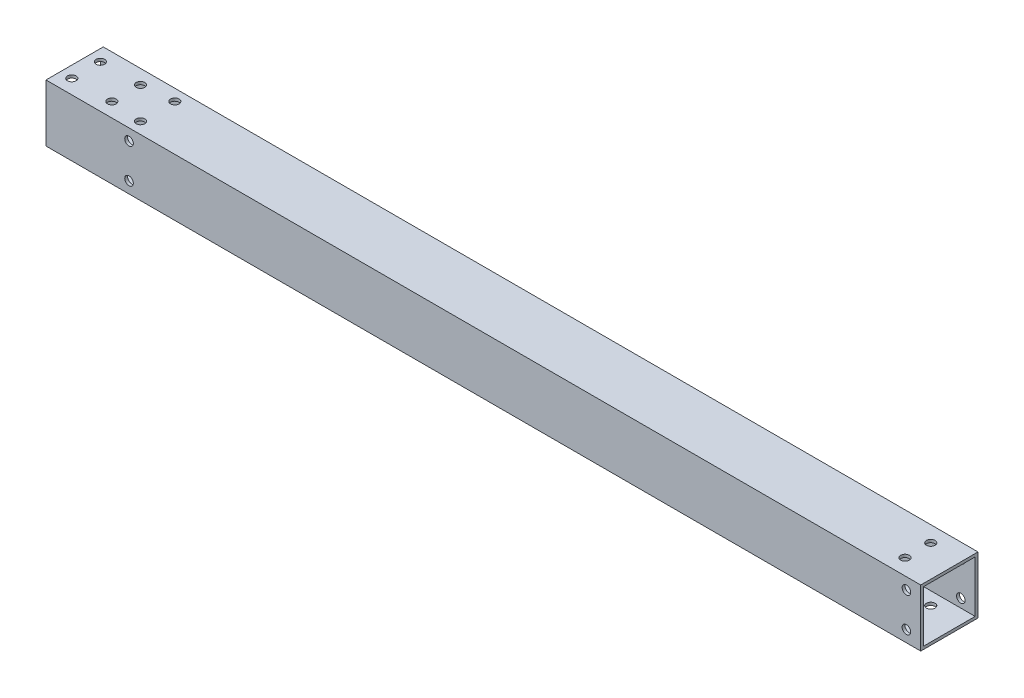
ISO-10303-21;
HEADER;
FILE_DESCRIPTION(('STEP AP214'),'2;1');
FILE_NAME('part.step','',(''),(''),'','','');
FILE_SCHEMA(('AUTOMOTIVE_DESIGN { 1 0 10303 214 1 1 1 1 }'));
ENDSEC;
DATA;
#1=APPLICATION_CONTEXT('core data for automotive mechanical design processes');
#2=APPLICATION_PROTOCOL_DEFINITION('international standard','automotive_design',2000,#1);
#3=PRODUCT_CONTEXT('',#1,'mechanical');
#4=PRODUCT('Part','Part','',(#3));
#5=PRODUCT_RELATED_PRODUCT_CATEGORY('part','',(#4));
#6=PRODUCT_DEFINITION_FORMATION('','',#4);
#7=PRODUCT_DEFINITION_CONTEXT('part definition',#1,'design');
#8=PRODUCT_DEFINITION('design','',#6,#7);
#9=PRODUCT_DEFINITION_SHAPE('','',#8);
#10=(LENGTH_UNIT() NAMED_UNIT(*) SI_UNIT(.MILLI.,.METRE.));
#11=(NAMED_UNIT(*) PLANE_ANGLE_UNIT() SI_UNIT($,.RADIAN.));
#12=(NAMED_UNIT(*) SI_UNIT($,.STERADIAN.) SOLID_ANGLE_UNIT());
#13=UNCERTAINTY_MEASURE_WITH_UNIT(LENGTH_MEASURE(1.E-05),#10,'distance_accuracy_value','');
#14=(GEOMETRIC_REPRESENTATION_CONTEXT(3) GLOBAL_UNCERTAINTY_ASSIGNED_CONTEXT((#13)) GLOBAL_UNIT_ASSIGNED_CONTEXT((#10,
#11,#12)) REPRESENTATION_CONTEXT('',''));
#15=CARTESIAN_POINT('',(0.,0.,0.));
#16=DIRECTION('',(0.,0.,1.));
#17=DIRECTION('',(1.,0.,0.));
#18=AXIS2_PLACEMENT_3D('',#15,#16,#17);
#19=CARTESIAN_POINT('',(305.54,-9.,-9.));
#20=DIRECTION('',(0.,0.,1.));
#21=DIRECTION('',(1.,0.,0.));
#22=AXIS2_PLACEMENT_3D('',#19,#20,#21);
#23=PLANE('',#22);
#24=CARTESIAN_POINT('',(300.54,6.,-9.));
#25=DIRECTION('',(0.,0.,1.));
#26=DIRECTION('',(1.,0.,0.));
#27=AXIS2_PLACEMENT_3D('',#24,#25,#26);
#28=CIRCLE('',#27,1.50000000000002);
#29=CARTESIAN_POINT('',(302.04,6.,-9.));
#30=VERTEX_POINT('',#29);
#31=EDGE_CURVE('E244',#30,#30,#28,.T.);
#32=ORIENTED_EDGE('',*,*,#31,.F.);
#33=EDGE_LOOP('',(#32));
#34=FACE_BOUND('',#33,.T.);
#35=CARTESIAN_POINT('',(300.54,-6.,-9.));
#36=DIRECTION('',(0.,0.,1.));
#37=DIRECTION('',(1.,0.,0.));
#38=AXIS2_PLACEMENT_3D('',#35,#36,#37);
#39=CIRCLE('',#38,1.50000000000002);
#40=CARTESIAN_POINT('',(302.04,-6.,-9.));
#41=VERTEX_POINT('',#40);
#42=EDGE_CURVE('E238',#41,#41,#39,.T.);
#43=ORIENTED_EDGE('',*,*,#42,.F.);
#44=EDGE_LOOP('',(#43));
#45=FACE_BOUND('',#44,.T.);
#46=CARTESIAN_POINT('',(29.,-6.,-9.));
#47=DIRECTION('',(0.,0.,1.));
#48=DIRECTION('',(1.,0.,0.));
#49=AXIS2_PLACEMENT_3D('',#46,#47,#48);
#50=CIRCLE('',#49,1.5);
#51=CARTESIAN_POINT('',(30.5,-6.,-9.));
#52=VERTEX_POINT('',#51);
#53=EDGE_CURVE('E285',#52,#52,#50,.F.);
#54=ORIENTED_EDGE('',*,*,#53,.T.);
#55=EDGE_LOOP('',(#54));
#56=FACE_BOUND('',#55,.T.);
#57=CARTESIAN_POINT('',(29.,6.,-9.));
#58=DIRECTION('',(0.,0.,1.));
#59=DIRECTION('',(1.,0.,0.));
#60=AXIS2_PLACEMENT_3D('',#57,#58,#59);
#61=CIRCLE('',#60,1.5);
#62=CARTESIAN_POINT('',(30.5,6.,-9.));
#63=VERTEX_POINT('',#62);
#64=EDGE_CURVE('E152',#63,#63,#61,.F.);
#65=ORIENTED_EDGE('',*,*,#64,.T.);
#66=EDGE_LOOP('',(#65));
#67=FACE_BOUND('',#66,.T.);
#68=DIRECTION('',(0.,1.,0.));
#69=VECTOR('',#68,1.);
#70=CARTESIAN_POINT('',(0.,-9.,-9.));
#71=LINE('',#70,#69);
#72=CARTESIAN_POINT('',(0.,-9.,-9.));
#73=VERTEX_POINT('',#72);
#74=CARTESIAN_POINT('',(0.,9.,-9.));
#75=VERTEX_POINT('',#74);
#76=EDGE_CURVE('E158',#73,#75,#71,.T.);
#77=ORIENTED_EDGE('',*,*,#76,.F.);
#78=DIRECTION('',(-1.,0.,0.));
#79=VECTOR('',#78,1.);
#80=CARTESIAN_POINT('',(305.54,-9.,-9.));
#81=LINE('',#80,#79);
#82=CARTESIAN_POINT('',(305.54,-9.,-9.));
#83=VERTEX_POINT('',#82);
#84=EDGE_CURVE('E12',#83,#73,#81,.T.);
#85=ORIENTED_EDGE('',*,*,#84,.F.);
#86=DIRECTION('',(0.,1.,0.));
#87=VECTOR('',#86,1.);
#88=CARTESIAN_POINT('',(305.54,-9.,-9.));
#89=LINE('',#88,#87);
#90=CARTESIAN_POINT('',(305.54,9.,-9.));
#91=VERTEX_POINT('',#90);
#92=EDGE_CURVE('E139',#83,#91,#89,.T.);
#93=ORIENTED_EDGE('',*,*,#92,.T.);
#94=DIRECTION('',(-1.,0.,0.));
#95=VECTOR('',#94,1.);
#96=CARTESIAN_POINT('',(305.54,9.,-9.));
#97=LINE('',#96,#95);
#98=EDGE_CURVE('E70',#91,#75,#97,.T.);
#99=ORIENTED_EDGE('',*,*,#98,.T.);
#100=EDGE_LOOP('',(#77,#85,#93,#99));
#101=FACE_BOUND('',#100,.T.);
#102=ADVANCED_FACE('F51',(#34,#45,#56,#67,#101),#23,.T.);
#103=CARTESIAN_POINT('',(305.54,-9.,9.));
#104=DIRECTION('',(0.,1.,0.));
#105=DIRECTION('',(0.,0.,1.));
#106=AXIS2_PLACEMENT_3D('',#103,#104,#105);
#107=PLANE('',#106);
#108=CARTESIAN_POINT('',(4.,-9.,5.));
#109=DIRECTION('',(0.,1.,0.));
#110=DIRECTION('',(0.,0.,1.));
#111=AXIS2_PLACEMENT_3D('',#108,#109,#110);
#112=CIRCLE('',#111,1.5);
#113=CARTESIAN_POINT('',(4.,-9.,6.5));
#114=VERTEX_POINT('',#113);
#115=EDGE_CURVE('E220',#114,#114,#112,.T.);
#116=ORIENTED_EDGE('',*,*,#115,.F.);
#117=EDGE_LOOP('',(#116));
#118=FACE_BOUND('',#117,.T.);
#119=CARTESIAN_POINT('',(18.,-9.,-5.));
#120=DIRECTION('',(0.,1.,0.));
#121=DIRECTION('',(0.,0.,1.));
#122=AXIS2_PLACEMENT_3D('',#119,#120,#121);
#123=CIRCLE('',#122,1.5);
#124=CARTESIAN_POINT('',(18.,-9.,-3.5));
#125=VERTEX_POINT('',#124);
#126=EDGE_CURVE('E208',#125,#125,#123,.T.);
#127=ORIENTED_EDGE('',*,*,#126,.F.);
#128=EDGE_LOOP('',(#127));
#129=FACE_BOUND('',#128,.T.);
#130=CARTESIAN_POINT('',(18.,-9.,5.));
#131=DIRECTION('',(0.,1.,0.));
#132=DIRECTION('',(0.,0.,1.));
#133=AXIS2_PLACEMENT_3D('',#130,#131,#132);
#134=CIRCLE('',#133,1.5);
#135=CARTESIAN_POINT('',(18.,-9.,6.5));
#136=VERTEX_POINT('',#135);
#137=EDGE_CURVE('E205',#136,#136,#134,.T.);
#138=ORIENTED_EDGE('',*,*,#137,.F.);
#139=EDGE_LOOP('',(#138));
#140=FACE_BOUND('',#139,.T.);
#141=CARTESIAN_POINT('',(4.,-9.,-5.));
#142=DIRECTION('',(0.,1.,0.));
#143=DIRECTION('',(0.,0.,1.));
#144=AXIS2_PLACEMENT_3D('',#141,#142,#143);
#145=CIRCLE('',#144,1.5);
#146=CARTESIAN_POINT('',(4.,-9.,-3.5));
#147=VERTEX_POINT('',#146);
#148=EDGE_CURVE('E201',#147,#147,#145,.T.);
#149=ORIENTED_EDGE('',*,*,#148,.F.);
#150=EDGE_LOOP('',(#149));
#151=FACE_BOUND('',#150,.T.);
#152=CARTESIAN_POINT('',(294.54,-9.,-4.5));
#153=DIRECTION('',(0.,1.,0.));
#154=DIRECTION('',(0.,0.,1.));
#155=AXIS2_PLACEMENT_3D('',#152,#153,#154);
#156=CIRCLE('',#155,1.50000000000002);
#157=CARTESIAN_POINT('',(294.54,-9.,-2.99999999999997));
#158=VERTEX_POINT('',#157);
#159=EDGE_CURVE('E197',#158,#158,#156,.T.);
#160=ORIENTED_EDGE('',*,*,#159,.F.);
#161=EDGE_LOOP('',(#160));
#162=FACE_BOUND('',#161,.T.);
#163=CARTESIAN_POINT('',(294.54,-9.,4.5));
#164=DIRECTION('',(0.,1.,0.));
#165=DIRECTION('',(0.,0.,1.));
#166=AXIS2_PLACEMENT_3D('',#163,#164,#165);
#167=CIRCLE('',#166,1.50000000000002);
#168=CARTESIAN_POINT('',(294.54,-9.,6.00000000000003));
#169=VERTEX_POINT('',#168);
#170=EDGE_CURVE('E192',#169,#169,#167,.T.);
#171=ORIENTED_EDGE('',*,*,#170,.F.);
#172=EDGE_LOOP('',(#171));
#173=FACE_BOUND('',#172,.T.);
#174=CARTESIAN_POINT('',(29.,-9.,6.));
#175=DIRECTION('',(0.,1.,0.));
#176=DIRECTION('',(0.,0.,1.));
#177=AXIS2_PLACEMENT_3D('',#174,#175,#176);
#178=CIRCLE('',#177,1.5);
#179=CARTESIAN_POINT('',(29.,-9.,7.5));
#180=VERTEX_POINT('',#179);
#181=EDGE_CURVE('E187',#180,#180,#178,.T.);
#182=ORIENTED_EDGE('',*,*,#181,.F.);
#183=EDGE_LOOP('',(#182));
#184=FACE_BOUND('',#183,.T.);
#185=CARTESIAN_POINT('',(29.,-9.,-6.));
#186=DIRECTION('',(0.,1.,0.));
#187=DIRECTION('',(0.,0.,1.));
#188=AXIS2_PLACEMENT_3D('',#185,#186,#187);
#189=CIRCLE('',#188,1.5);
#190=CARTESIAN_POINT('',(29.,-9.,-4.5));
#191=VERTEX_POINT('',#190);
#192=EDGE_CURVE('E182',#191,#191,#189,.T.);
#193=ORIENTED_EDGE('',*,*,#192,.F.);
#194=EDGE_LOOP('',(#193));
#195=FACE_BOUND('',#194,.T.);
#196=DIRECTION('',(0.,0.,-1.));
#197=VECTOR('',#196,1.);
#198=CARTESIAN_POINT('',(0.,-9.,9.));
#199=LINE('',#198,#197);
#200=CARTESIAN_POINT('',(0.,-9.,9.));
#201=VERTEX_POINT('',#200);
#202=EDGE_CURVE('E128',#201,#73,#199,.T.);
#203=ORIENTED_EDGE('',*,*,#202,.F.);
#204=DIRECTION('',(-1.,0.,0.));
#205=VECTOR('',#204,1.);
#206=CARTESIAN_POINT('',(305.54,-9.,9.));
#207=LINE('',#206,#205);
#208=CARTESIAN_POINT('',(305.54,-9.,9.));
#209=VERTEX_POINT('',#208);
#210=EDGE_CURVE('E61',#209,#201,#207,.T.);
#211=ORIENTED_EDGE('',*,*,#210,.F.);
#212=DIRECTION('',(0.,0.,-1.));
#213=VECTOR('',#212,1.);
#214=CARTESIAN_POINT('',(305.54,-9.,9.));
#215=LINE('',#214,#213);
#216=EDGE_CURVE('E126',#209,#83,#215,.T.);
#217=ORIENTED_EDGE('',*,*,#216,.T.);
#218=ORIENTED_EDGE('',*,*,#84,.T.);
#219=EDGE_LOOP('',(#203,#211,#217,#218));
#220=FACE_BOUND('',#219,.T.);
#221=ADVANCED_FACE('F125',(#118,#129,#140,#151,#162,#173,#184,#195,#220),#107,.T.);
#222=CARTESIAN_POINT('',(305.54,-9.,9.));
#223=DIRECTION('',(0.,0.,-1.));
#224=DIRECTION('',(-1.,0.,0.));
#225=AXIS2_PLACEMENT_3D('',#222,#223,#224);
#226=PLANE('',#225);
#227=CARTESIAN_POINT('',(300.54,6.,9.));
#228=DIRECTION('',(0.,0.,-1.));
#229=DIRECTION('',(-1.,0.,0.));
#230=AXIS2_PLACEMENT_3D('',#227,#228,#229);
#231=CIRCLE('',#230,1.50000000000002);
#232=CARTESIAN_POINT('',(299.04,6.,9.));
#233=VERTEX_POINT('',#232);
#234=EDGE_CURVE('E241',#233,#233,#231,.T.);
#235=ORIENTED_EDGE('',*,*,#234,.F.);
#236=EDGE_LOOP('',(#235));
#237=FACE_BOUND('',#236,.T.);
#238=CARTESIAN_POINT('',(300.54,-6.,9.));
#239=DIRECTION('',(0.,0.,-1.));
#240=DIRECTION('',(-1.,0.,0.));
#241=AXIS2_PLACEMENT_3D('',#238,#239,#240);
#242=CIRCLE('',#241,1.50000000000002);
#243=CARTESIAN_POINT('',(299.04,-6.,9.));
#244=VERTEX_POINT('',#243);
#245=EDGE_CURVE('E227',#244,#244,#242,.T.);
#246=ORIENTED_EDGE('',*,*,#245,.F.);
#247=EDGE_LOOP('',(#246));
#248=FACE_BOUND('',#247,.T.);
#249=CARTESIAN_POINT('',(29.,-6.,9.));
#250=DIRECTION('',(0.,0.,-1.));
#251=DIRECTION('',(-1.,0.,0.));
#252=AXIS2_PLACEMENT_3D('',#249,#250,#251);
#253=CIRCLE('',#252,1.5);
#254=CARTESIAN_POINT('',(27.5,-6.,9.));
#255=VERTEX_POINT('',#254);
#256=EDGE_CURVE('E280',#255,#255,#253,.F.);
#257=ORIENTED_EDGE('',*,*,#256,.T.);
#258=EDGE_LOOP('',(#257));
#259=FACE_BOUND('',#258,.T.);
#260=CARTESIAN_POINT('',(29.,6.,9.));
#261=DIRECTION('',(0.,0.,-1.));
#262=DIRECTION('',(-1.,0.,0.));
#263=AXIS2_PLACEMENT_3D('',#260,#261,#262);
#264=CIRCLE('',#263,1.5);
#265=CARTESIAN_POINT('',(27.5,6.,9.));
#266=VERTEX_POINT('',#265);
#267=EDGE_CURVE('E292',#266,#266,#264,.F.);
#268=ORIENTED_EDGE('',*,*,#267,.T.);
#269=EDGE_LOOP('',(#268));
#270=FACE_BOUND('',#269,.T.);
#271=DIRECTION('',(0.,-1.,0.));
#272=VECTOR('',#271,1.);
#273=CARTESIAN_POINT('',(0.,-9.,9.));
#274=LINE('',#273,#272);
#275=CARTESIAN_POINT('',(0.,9.,9.));
#276=VERTEX_POINT('',#275);
#277=EDGE_CURVE('E161',#276,#201,#274,.T.);
#278=ORIENTED_EDGE('',*,*,#277,.F.);
#279=DIRECTION('',(-1.,0.,0.));
#280=VECTOR('',#279,1.);
#281=CARTESIAN_POINT('',(305.54,9.,9.));
#282=LINE('',#281,#280);
#283=CARTESIAN_POINT('',(305.54,9.,9.));
#284=VERTEX_POINT('',#283);
#285=EDGE_CURVE('E95',#284,#276,#282,.T.);
#286=ORIENTED_EDGE('',*,*,#285,.F.);
#287=DIRECTION('',(0.,-1.,0.));
#288=VECTOR('',#287,1.);
#289=CARTESIAN_POINT('',(305.54,-9.,9.));
#290=LINE('',#289,#288);
#291=EDGE_CURVE('E138',#284,#209,#290,.T.);
#292=ORIENTED_EDGE('',*,*,#291,.T.);
#293=ORIENTED_EDGE('',*,*,#210,.T.);
#294=EDGE_LOOP('',(#278,#286,#292,#293));
#295=FACE_BOUND('',#294,.T.);
#296=ADVANCED_FACE('F141',(#237,#248,#259,#270,#295),#226,.T.);
#297=CARTESIAN_POINT('',(305.54,-10.,-10.));
#298=DIRECTION('',(0.,0.,1.));
#299=DIRECTION('',(1.,0.,0.));
#300=AXIS2_PLACEMENT_3D('',#297,#298,#299);
#301=PLANE('',#300);
#302=CARTESIAN_POINT('',(300.54,6.,-10.));
#303=DIRECTION('',(0.,0.,-1.));
#304=DIRECTION('',(-1.,0.,0.));
#305=AXIS2_PLACEMENT_3D('',#302,#303,#304);
#306=CIRCLE('',#305,1.50000000000002);
#307=CARTESIAN_POINT('',(299.04,6.,-10.));
#308=VERTEX_POINT('',#307);
#309=EDGE_CURVE('E228',#308,#308,#306,.T.);
#310=ORIENTED_EDGE('',*,*,#309,.F.);
#311=EDGE_LOOP('',(#310));
#312=FACE_BOUND('',#311,.T.);
#313=CARTESIAN_POINT('',(300.54,-6.,-10.));
#314=DIRECTION('',(0.,0.,-1.));
#315=DIRECTION('',(-1.,0.,0.));
#316=AXIS2_PLACEMENT_3D('',#313,#314,#315);
#317=CIRCLE('',#316,1.50000000000002);
#318=CARTESIAN_POINT('',(299.04,-6.,-10.));
#319=VERTEX_POINT('',#318);
#320=EDGE_CURVE('E223',#319,#319,#317,.T.);
#321=ORIENTED_EDGE('',*,*,#320,.F.);
#322=EDGE_LOOP('',(#321));
#323=FACE_BOUND('',#322,.T.);
#324=CARTESIAN_POINT('',(29.,-6.,-10.));
#325=DIRECTION('',(0.,0.,-1.));
#326=DIRECTION('',(-1.,0.,0.));
#327=AXIS2_PLACEMENT_3D('',#324,#325,#326);
#328=CIRCLE('',#327,1.5);
#329=CARTESIAN_POINT('',(27.5,-6.,-10.));
#330=VERTEX_POINT('',#329);
#331=EDGE_CURVE('E277',#330,#330,#328,.T.);
#332=ORIENTED_EDGE('',*,*,#331,.F.);
#333=EDGE_LOOP('',(#332));
#334=FACE_BOUND('',#333,.T.);
#335=CARTESIAN_POINT('',(29.,6.,-10.));
#336=DIRECTION('',(0.,0.,-1.));
#337=DIRECTION('',(-1.,0.,0.));
#338=AXIS2_PLACEMENT_3D('',#335,#336,#337);
#339=CIRCLE('',#338,1.5);
#340=CARTESIAN_POINT('',(27.5,6.,-10.));
#341=VERTEX_POINT('',#340);
#342=EDGE_CURVE('E289',#341,#341,#339,.T.);
#343=ORIENTED_EDGE('',*,*,#342,.F.);
#344=EDGE_LOOP('',(#343));
#345=FACE_BOUND('',#344,.T.);
#346=DIRECTION('',(0.,1.,0.));
#347=VECTOR('',#346,1.);
#348=CARTESIAN_POINT('',(0.,-10.,-10.));
#349=LINE('',#348,#347);
#350=CARTESIAN_POINT('',(0.,-10.,-10.));
#351=VERTEX_POINT('',#350);
#352=CARTESIAN_POINT('',(0.,10.,-10.));
#353=VERTEX_POINT('',#352);
#354=EDGE_CURVE('E148',#351,#353,#349,.T.);
#355=ORIENTED_EDGE('',*,*,#354,.T.);
#356=DIRECTION('',(-1.,0.,0.));
#357=VECTOR('',#356,1.);
#358=CARTESIAN_POINT('',(305.54,10.,-10.));
#359=LINE('',#358,#357);
#360=CARTESIAN_POINT('',(305.54,10.,-10.));
#361=VERTEX_POINT('',#360);
#362=EDGE_CURVE('E168',#361,#353,#359,.T.);
#363=ORIENTED_EDGE('',*,*,#362,.F.);
#364=DIRECTION('',(0.,1.,0.));
#365=VECTOR('',#364,1.);
#366=CARTESIAN_POINT('',(305.54,-10.,-10.));
#367=LINE('',#366,#365);
#368=CARTESIAN_POINT('',(305.54,-10.,-10.));
#369=VERTEX_POINT('',#368);
#370=EDGE_CURVE('E166',#369,#361,#367,.T.);
#371=ORIENTED_EDGE('',*,*,#370,.F.);
#372=DIRECTION('',(-1.,0.,0.));
#373=VECTOR('',#372,1.);
#374=CARTESIAN_POINT('',(305.54,-10.,-10.));
#375=LINE('',#374,#373);
#376=EDGE_CURVE('E144',#369,#351,#375,.T.);
#377=ORIENTED_EDGE('',*,*,#376,.T.);
#378=EDGE_LOOP('',(#355,#363,#371,#377));
#379=FACE_BOUND('',#378,.T.);
#380=ADVANCED_FACE('F53',(#312,#323,#334,#345,#379),#301,.F.);
#381=CARTESIAN_POINT('',(305.54,10.,10.));
#382=DIRECTION('',(0.,-1.,0.));
#383=DIRECTION('',(0.,0.,-1.));
#384=AXIS2_PLACEMENT_3D('',#381,#382,#383);
#385=PLANE('',#384);
#386=CARTESIAN_POINT('',(4.,10.,5.));
#387=DIRECTION('',(0.,1.,0.));
#388=DIRECTION('',(0.,0.,1.));
#389=AXIS2_PLACEMENT_3D('',#386,#387,#388);
#390=CIRCLE('',#389,1.5);
#391=CARTESIAN_POINT('',(4.,10.,6.5));
#392=VERTEX_POINT('',#391);
#393=EDGE_CURVE('E346',#392,#392,#390,.T.);
#394=ORIENTED_EDGE('',*,*,#393,.F.);
#395=EDGE_LOOP('',(#394));
#396=FACE_BOUND('',#395,.T.);
#397=CARTESIAN_POINT('',(18.,10.,-5.));
#398=DIRECTION('',(0.,1.,0.));
#399=DIRECTION('',(0.,0.,1.));
#400=AXIS2_PLACEMENT_3D('',#397,#398,#399);
#401=CIRCLE('',#400,1.5);
#402=CARTESIAN_POINT('',(18.,10.,-3.5));
#403=VERTEX_POINT('',#402);
#404=EDGE_CURVE('E350',#403,#403,#401,.T.);
#405=ORIENTED_EDGE('',*,*,#404,.F.);
#406=EDGE_LOOP('',(#405));
#407=FACE_BOUND('',#406,.T.);
#408=CARTESIAN_POINT('',(18.,10.,5.));
#409=DIRECTION('',(0.,1.,0.));
#410=DIRECTION('',(0.,0.,1.));
#411=AXIS2_PLACEMENT_3D('',#408,#409,#410);
#412=CIRCLE('',#411,1.5);
#413=CARTESIAN_POINT('',(18.,10.,6.5));
#414=VERTEX_POINT('',#413);
#415=EDGE_CURVE('E354',#414,#414,#412,.T.);
#416=ORIENTED_EDGE('',*,*,#415,.F.);
#417=EDGE_LOOP('',(#416));
#418=FACE_BOUND('',#417,.T.);
#419=CARTESIAN_POINT('',(4.,10.,-5.));
#420=DIRECTION('',(0.,1.,0.));
#421=DIRECTION('',(0.,0.,1.));
#422=AXIS2_PLACEMENT_3D('',#419,#420,#421);
#423=CIRCLE('',#422,1.5);
#424=CARTESIAN_POINT('',(4.,10.,-3.5));
#425=VERTEX_POINT('',#424);
#426=EDGE_CURVE('E358',#425,#425,#423,.T.);
#427=ORIENTED_EDGE('',*,*,#426,.F.);
#428=EDGE_LOOP('',(#427));
#429=FACE_BOUND('',#428,.T.);
#430=CARTESIAN_POINT('',(294.54,10.,-4.5));
#431=DIRECTION('',(0.,1.,0.));
#432=DIRECTION('',(0.,0.,1.));
#433=AXIS2_PLACEMENT_3D('',#430,#431,#432);
#434=CIRCLE('',#433,1.50000000000002);
#435=CARTESIAN_POINT('',(294.54,10.,-2.99999999999997));
#436=VERTEX_POINT('',#435);
#437=EDGE_CURVE('E250',#436,#436,#434,.T.);
#438=ORIENTED_EDGE('',*,*,#437,.F.);
#439=EDGE_LOOP('',(#438));
#440=FACE_BOUND('',#439,.T.);
#441=CARTESIAN_POINT('',(294.54,10.,4.5));
#442=DIRECTION('',(0.,1.,0.));
#443=DIRECTION('',(0.,0.,1.));
#444=AXIS2_PLACEMENT_3D('',#441,#442,#443);
#445=CIRCLE('',#444,1.50000000000002);
#446=CARTESIAN_POINT('',(294.54,10.,6.00000000000003));
#447=VERTEX_POINT('',#446);
#448=EDGE_CURVE('E247',#447,#447,#445,.T.);
#449=ORIENTED_EDGE('',*,*,#448,.F.);
#450=EDGE_LOOP('',(#449));
#451=FACE_BOUND('',#450,.T.);
#452=CARTESIAN_POINT('',(29.,10.,6.));
#453=DIRECTION('',(0.,1.,0.));
#454=DIRECTION('',(0.,0.,1.));
#455=AXIS2_PLACEMENT_3D('',#452,#453,#454);
#456=CIRCLE('',#455,1.5);
#457=CARTESIAN_POINT('',(29.,10.,7.5));
#458=VERTEX_POINT('',#457);
#459=EDGE_CURVE('E262',#458,#458,#456,.T.);
#460=ORIENTED_EDGE('',*,*,#459,.F.);
#461=EDGE_LOOP('',(#460));
#462=FACE_BOUND('',#461,.T.);
#463=CARTESIAN_POINT('',(29.,10.,-6.));
#464=DIRECTION('',(0.,1.,0.));
#465=DIRECTION('',(0.,0.,1.));
#466=AXIS2_PLACEMENT_3D('',#463,#464,#465);
#467=CIRCLE('',#466,1.5);
#468=CARTESIAN_POINT('',(29.,10.,-4.5));
#469=VERTEX_POINT('',#468);
#470=EDGE_CURVE('E269',#469,#469,#467,.T.);
#471=ORIENTED_EDGE('',*,*,#470,.F.);
#472=EDGE_LOOP('',(#471));
#473=FACE_BOUND('',#472,.T.);
#474=DIRECTION('',(0.,0.,1.));
#475=VECTOR('',#474,1.);
#476=CARTESIAN_POINT('',(0.,10.,10.));
#477=LINE('',#476,#475);
#478=CARTESIAN_POINT('',(0.,10.,10.));
#479=VERTEX_POINT('',#478);
#480=EDGE_CURVE('E151',#353,#479,#477,.T.);
#481=ORIENTED_EDGE('',*,*,#480,.T.);
#482=DIRECTION('',(-1.,0.,0.));
#483=VECTOR('',#482,1.);
#484=CARTESIAN_POINT('',(305.54,10.,10.));
#485=LINE('',#484,#483);
#486=CARTESIAN_POINT('',(305.54,10.,10.));
#487=VERTEX_POINT('',#486);
#488=EDGE_CURVE('E175',#487,#479,#485,.T.);
#489=ORIENTED_EDGE('',*,*,#488,.F.);
#490=DIRECTION('',(0.,0.,1.));
#491=VECTOR('',#490,1.);
#492=CARTESIAN_POINT('',(305.54,10.,10.));
#493=LINE('',#492,#491);
#494=EDGE_CURVE('E108',#361,#487,#493,.T.);
#495=ORIENTED_EDGE('',*,*,#494,.F.);
#496=ORIENTED_EDGE('',*,*,#362,.T.);
#497=EDGE_LOOP('',(#481,#489,#495,#496));
#498=FACE_BOUND('',#497,.T.);
#499=ADVANCED_FACE('F335',(#396,#407,#418,#429,#440,#451,#462,#473,#498),#385,.F.);
#500=CARTESIAN_POINT('',(305.54,-10.,10.));
#501=DIRECTION('',(0.,0.,-1.));
#502=DIRECTION('',(-1.,0.,0.));
#503=AXIS2_PLACEMENT_3D('',#500,#501,#502);
#504=PLANE('',#503);
#505=CARTESIAN_POINT('',(300.54,6.,10.));
#506=DIRECTION('',(0.,0.,-1.));
#507=DIRECTION('',(-1.,0.,0.));
#508=AXIS2_PLACEMENT_3D('',#505,#506,#507);
#509=CIRCLE('',#508,1.50000000000002);
#510=CARTESIAN_POINT('',(299.04,6.,10.));
#511=VERTEX_POINT('',#510);
#512=EDGE_CURVE('E224',#511,#511,#509,.T.);
#513=ORIENTED_EDGE('',*,*,#512,.T.);
#514=EDGE_LOOP('',(#513));
#515=FACE_BOUND('',#514,.T.);
#516=CARTESIAN_POINT('',(300.54,-6.,10.));
#517=DIRECTION('',(0.,0.,-1.));
#518=DIRECTION('',(-1.,0.,0.));
#519=AXIS2_PLACEMENT_3D('',#516,#517,#518);
#520=CIRCLE('',#519,1.50000000000002);
#521=CARTESIAN_POINT('',(299.04,-6.,10.));
#522=VERTEX_POINT('',#521);
#523=EDGE_CURVE('E231',#522,#522,#520,.T.);
#524=ORIENTED_EDGE('',*,*,#523,.T.);
#525=EDGE_LOOP('',(#524));
#526=FACE_BOUND('',#525,.T.);
#527=CARTESIAN_POINT('',(29.,-6.,10.));
#528=DIRECTION('',(0.,0.,-1.));
#529=DIRECTION('',(-1.,0.,0.));
#530=AXIS2_PLACEMENT_3D('',#527,#528,#529);
#531=CIRCLE('',#530,1.5);
#532=CARTESIAN_POINT('',(27.5,-6.,10.));
#533=VERTEX_POINT('',#532);
#534=EDGE_CURVE('E276',#533,#533,#531,.T.);
#535=ORIENTED_EDGE('',*,*,#534,.T.);
#536=EDGE_LOOP('',(#535));
#537=FACE_BOUND('',#536,.T.);
#538=CARTESIAN_POINT('',(29.,6.,10.));
#539=DIRECTION('',(0.,0.,-1.));
#540=DIRECTION('',(-1.,0.,0.));
#541=AXIS2_PLACEMENT_3D('',#538,#539,#540);
#542=CIRCLE('',#541,1.5);
#543=CARTESIAN_POINT('',(27.5,6.,10.));
#544=VERTEX_POINT('',#543);
#545=EDGE_CURVE('E288',#544,#544,#542,.T.);
#546=ORIENTED_EDGE('',*,*,#545,.T.);
#547=EDGE_LOOP('',(#546));
#548=FACE_BOUND('',#547,.T.);
#549=DIRECTION('',(0.,-1.,0.));
#550=VECTOR('',#549,1.);
#551=CARTESIAN_POINT('',(0.,-10.,10.));
#552=LINE('',#551,#550);
#553=CARTESIAN_POINT('',(0.,-10.,10.));
#554=VERTEX_POINT('',#553);
#555=EDGE_CURVE('E154',#479,#554,#552,.T.);
#556=ORIENTED_EDGE('',*,*,#555,.T.);
#557=DIRECTION('',(-1.,0.,0.));
#558=VECTOR('',#557,1.);
#559=CARTESIAN_POINT('',(305.54,-10.,10.));
#560=LINE('',#559,#558);
#561=CARTESIAN_POINT('',(305.54,-10.,10.));
#562=VERTEX_POINT('',#561);
#563=EDGE_CURVE('E172',#562,#554,#560,.T.);
#564=ORIENTED_EDGE('',*,*,#563,.F.);
#565=DIRECTION('',(0.,-1.,0.));
#566=VECTOR('',#565,1.);
#567=CARTESIAN_POINT('',(305.54,-10.,10.));
#568=LINE('',#567,#566);
#569=EDGE_CURVE('E301',#487,#562,#568,.T.);
#570=ORIENTED_EDGE('',*,*,#569,.F.);
#571=ORIENTED_EDGE('',*,*,#488,.T.);
#572=EDGE_LOOP('',(#556,#564,#570,#571));
#573=FACE_BOUND('',#572,.T.);
#574=ADVANCED_FACE('F316',(#515,#526,#537,#548,#573),#504,.F.);
#575=CARTESIAN_POINT('',(305.54,-10.,10.));
#576=DIRECTION('',(0.,1.,0.));
#577=DIRECTION('',(0.,0.,1.));
#578=AXIS2_PLACEMENT_3D('',#575,#576,#577);
#579=PLANE('',#578);
#580=CARTESIAN_POINT('',(4.,-10.,5.));
#581=DIRECTION('',(0.,1.,0.));
#582=DIRECTION('',(0.,0.,1.));
#583=AXIS2_PLACEMENT_3D('',#580,#581,#582);
#584=CIRCLE('',#583,1.5);
#585=CARTESIAN_POINT('',(4.,-10.,6.5));
#586=VERTEX_POINT('',#585);
#587=EDGE_CURVE('E462',#586,#586,#584,.T.);
#588=ORIENTED_EDGE('',*,*,#587,.T.);
#589=EDGE_LOOP('',(#588));
#590=FACE_BOUND('',#589,.T.);
#591=CARTESIAN_POINT('',(18.,-10.,-5.));
#592=DIRECTION('',(0.,1.,0.));
#593=DIRECTION('',(0.,0.,1.));
#594=AXIS2_PLACEMENT_3D('',#591,#592,#593);
#595=CIRCLE('',#594,1.5);
#596=CARTESIAN_POINT('',(18.,-10.,-3.5));
#597=VERTEX_POINT('',#596);
#598=EDGE_CURVE('E458',#597,#597,#595,.T.);
#599=ORIENTED_EDGE('',*,*,#598,.T.);
#600=EDGE_LOOP('',(#599));
#601=FACE_BOUND('',#600,.T.);
#602=CARTESIAN_POINT('',(18.,-10.,5.));
#603=DIRECTION('',(0.,1.,0.));
#604=DIRECTION('',(0.,0.,1.));
#605=AXIS2_PLACEMENT_3D('',#602,#603,#604);
#606=CIRCLE('',#605,1.5);
#607=CARTESIAN_POINT('',(18.,-10.,6.5));
#608=VERTEX_POINT('',#607);
#609=EDGE_CURVE('E455',#608,#608,#606,.T.);
#610=ORIENTED_EDGE('',*,*,#609,.T.);
#611=EDGE_LOOP('',(#610));
#612=FACE_BOUND('',#611,.T.);
#613=CARTESIAN_POINT('',(4.,-10.,-5.));
#614=DIRECTION('',(0.,1.,0.));
#615=DIRECTION('',(0.,0.,1.));
#616=AXIS2_PLACEMENT_3D('',#613,#614,#615);
#617=CIRCLE('',#616,1.5);
#618=CARTESIAN_POINT('',(4.,-10.,-3.5));
#619=VERTEX_POINT('',#618);
#620=EDGE_CURVE('E202',#619,#619,#617,.T.);
#621=ORIENTED_EDGE('',*,*,#620,.T.);
#622=EDGE_LOOP('',(#621));
#623=FACE_BOUND('',#622,.T.);
#624=CARTESIAN_POINT('',(294.54,-10.,-4.5));
#625=DIRECTION('',(0.,1.,0.));
#626=DIRECTION('',(0.,0.,1.));
#627=AXIS2_PLACEMENT_3D('',#624,#625,#626);
#628=CIRCLE('',#627,1.50000000000002);
#629=CARTESIAN_POINT('',(294.54,-10.,-2.99999999999997));
#630=VERTEX_POINT('',#629);
#631=EDGE_CURVE('E193',#630,#630,#628,.T.);
#632=ORIENTED_EDGE('',*,*,#631,.T.);
#633=EDGE_LOOP('',(#632));
#634=FACE_BOUND('',#633,.T.);
#635=CARTESIAN_POINT('',(294.54,-10.,4.5));
#636=DIRECTION('',(0.,1.,0.));
#637=DIRECTION('',(0.,0.,1.));
#638=AXIS2_PLACEMENT_3D('',#635,#636,#637);
#639=CIRCLE('',#638,1.50000000000002);
#640=CARTESIAN_POINT('',(294.54,-10.,6.00000000000003));
#641=VERTEX_POINT('',#640);
#642=EDGE_CURVE('E253',#641,#641,#639,.T.);
#643=ORIENTED_EDGE('',*,*,#642,.T.);
#644=EDGE_LOOP('',(#643));
#645=FACE_BOUND('',#644,.T.);
#646=CARTESIAN_POINT('',(29.,-10.,6.));
#647=DIRECTION('',(0.,1.,0.));
#648=DIRECTION('',(0.,0.,1.));
#649=AXIS2_PLACEMENT_3D('',#646,#647,#648);
#650=CIRCLE('',#649,1.5);
#651=CARTESIAN_POINT('',(29.,-10.,7.5));
#652=VERTEX_POINT('',#651);
#653=EDGE_CURVE('E188',#652,#652,#650,.T.);
#654=ORIENTED_EDGE('',*,*,#653,.T.);
#655=EDGE_LOOP('',(#654));
#656=FACE_BOUND('',#655,.T.);
#657=CARTESIAN_POINT('',(29.,-10.,-6.));
#658=DIRECTION('',(0.,1.,0.));
#659=DIRECTION('',(0.,0.,1.));
#660=AXIS2_PLACEMENT_3D('',#657,#658,#659);
#661=CIRCLE('',#660,1.5);
#662=CARTESIAN_POINT('',(29.,-10.,-4.5));
#663=VERTEX_POINT('',#662);
#664=EDGE_CURVE('E183',#663,#663,#661,.T.);
#665=ORIENTED_EDGE('',*,*,#664,.T.);
#666=EDGE_LOOP('',(#665));
#667=FACE_BOUND('',#666,.T.);
#668=DIRECTION('',(0.,0.,-1.));
#669=VECTOR('',#668,1.);
#670=CARTESIAN_POINT('',(0.,-10.,10.));
#671=LINE('',#670,#669);
#672=EDGE_CURVE('E156',#554,#351,#671,.T.);
#673=ORIENTED_EDGE('',*,*,#672,.T.);
#674=ORIENTED_EDGE('',*,*,#376,.F.);
#675=DIRECTION('',(0.,0.,-1.));
#676=VECTOR('',#675,1.);
#677=CARTESIAN_POINT('',(305.54,-10.,10.));
#678=LINE('',#677,#676);
#679=EDGE_CURVE('E303',#562,#369,#678,.T.);
#680=ORIENTED_EDGE('',*,*,#679,.F.);
#681=ORIENTED_EDGE('',*,*,#563,.T.);
#682=EDGE_LOOP('',(#673,#674,#680,#681));
#683=FACE_BOUND('',#682,.T.);
#684=ADVANCED_FACE('F306',(#590,#601,#612,#623,#634,#645,#656,#667,#683),#579,.F.);
#685=CARTESIAN_POINT('',(305.54,9.,9.));
#686=DIRECTION('',(0.,-1.,0.));
#687=DIRECTION('',(0.,0.,-1.));
#688=AXIS2_PLACEMENT_3D('',#685,#686,#687);
#689=PLANE('',#688);
#690=CARTESIAN_POINT('',(4.,9.,5.));
#691=DIRECTION('',(0.,-1.,0.));
#692=DIRECTION('',(0.,0.,-1.));
#693=AXIS2_PLACEMENT_3D('',#690,#691,#692);
#694=CIRCLE('',#693,1.5);
#695=CARTESIAN_POINT('',(4.,9.,3.5));
#696=VERTEX_POINT('',#695);
#697=EDGE_CURVE('E55',#696,#696,#694,.T.);
#698=ORIENTED_EDGE('',*,*,#697,.F.);
#699=EDGE_LOOP('',(#698));
#700=FACE_BOUND('',#699,.T.);
#701=CARTESIAN_POINT('',(18.,9.,-5.));
#702=DIRECTION('',(0.,-1.,0.));
#703=DIRECTION('',(0.,0.,-1.));
#704=AXIS2_PLACEMENT_3D('',#701,#702,#703);
#705=CIRCLE('',#704,1.5);
#706=CARTESIAN_POINT('',(18.,9.,-6.5));
#707=VERTEX_POINT('',#706);
#708=EDGE_CURVE('E206',#707,#707,#705,.T.);
#709=ORIENTED_EDGE('',*,*,#708,.F.);
#710=EDGE_LOOP('',(#709));
#711=FACE_BOUND('',#710,.T.);
#712=CARTESIAN_POINT('',(18.,9.,5.));
#713=DIRECTION('',(0.,-1.,0.));
#714=DIRECTION('',(0.,0.,-1.));
#715=AXIS2_PLACEMENT_3D('',#712,#713,#714);
#716=CIRCLE('',#715,1.5);
#717=CARTESIAN_POINT('',(18.,9.,3.5));
#718=VERTEX_POINT('',#717);
#719=EDGE_CURVE('E203',#718,#718,#716,.T.);
#720=ORIENTED_EDGE('',*,*,#719,.F.);
#721=EDGE_LOOP('',(#720));
#722=FACE_BOUND('',#721,.T.);
#723=CARTESIAN_POINT('',(4.,9.,-5.));
#724=DIRECTION('',(0.,-1.,0.));
#725=DIRECTION('',(0.,0.,-1.));
#726=AXIS2_PLACEMENT_3D('',#723,#724,#725);
#727=CIRCLE('',#726,1.5);
#728=CARTESIAN_POINT('',(4.,9.,-6.5));
#729=VERTEX_POINT('',#728);
#730=EDGE_CURVE('E198',#729,#729,#727,.T.);
#731=ORIENTED_EDGE('',*,*,#730,.F.);
#732=EDGE_LOOP('',(#731));
#733=FACE_BOUND('',#732,.T.);
#734=CARTESIAN_POINT('',(294.54,9.,-4.5));
#735=DIRECTION('',(0.,-1.,0.));
#736=DIRECTION('',(0.,0.,-1.));
#737=AXIS2_PLACEMENT_3D('',#734,#735,#736);
#738=CIRCLE('',#737,1.50000000000002);
#739=CARTESIAN_POINT('',(294.54,9.,-6.00000000000002));
#740=VERTEX_POINT('',#739);
#741=EDGE_CURVE('E194',#740,#740,#738,.T.);
#742=ORIENTED_EDGE('',*,*,#741,.F.);
#743=EDGE_LOOP('',(#742));
#744=FACE_BOUND('',#743,.T.);
#745=CARTESIAN_POINT('',(294.54,9.,4.5));
#746=DIRECTION('',(0.,-1.,0.));
#747=DIRECTION('',(0.,0.,-1.));
#748=AXIS2_PLACEMENT_3D('',#745,#746,#747);
#749=CIRCLE('',#748,1.50000000000002);
#750=CARTESIAN_POINT('',(294.54,9.,2.99999999999998));
#751=VERTEX_POINT('',#750);
#752=EDGE_CURVE('E189',#751,#751,#749,.T.);
#753=ORIENTED_EDGE('',*,*,#752,.F.);
#754=EDGE_LOOP('',(#753));
#755=FACE_BOUND('',#754,.T.);
#756=CARTESIAN_POINT('',(29.,9.,6.));
#757=DIRECTION('',(0.,-1.,0.));
#758=DIRECTION('',(0.,0.,-1.));
#759=AXIS2_PLACEMENT_3D('',#756,#757,#758);
#760=CIRCLE('',#759,1.5);
#761=CARTESIAN_POINT('',(29.,9.,4.5));
#762=VERTEX_POINT('',#761);
#763=EDGE_CURVE('E184',#762,#762,#760,.T.);
#764=ORIENTED_EDGE('',*,*,#763,.F.);
#765=EDGE_LOOP('',(#764));
#766=FACE_BOUND('',#765,.T.);
#767=CARTESIAN_POINT('',(29.,9.,-6.));
#768=DIRECTION('',(0.,-1.,0.));
#769=DIRECTION('',(0.,0.,-1.));
#770=AXIS2_PLACEMENT_3D('',#767,#768,#769);
#771=CIRCLE('',#770,1.5);
#772=CARTESIAN_POINT('',(29.,9.,-7.5));
#773=VERTEX_POINT('',#772);
#774=EDGE_CURVE('E179',#773,#773,#771,.T.);
#775=ORIENTED_EDGE('',*,*,#774,.F.);
#776=EDGE_LOOP('',(#775));
#777=FACE_BOUND('',#776,.T.);
#778=DIRECTION('',(0.,0.,1.));
#779=VECTOR('',#778,1.);
#780=CARTESIAN_POINT('',(0.,9.,9.));
#781=LINE('',#780,#779);
#782=EDGE_CURVE('E163',#75,#276,#781,.T.);
#783=ORIENTED_EDGE('',*,*,#782,.F.);
#784=ORIENTED_EDGE('',*,*,#98,.F.);
#785=DIRECTION('',(0.,0.,1.));
#786=VECTOR('',#785,1.);
#787=CARTESIAN_POINT('',(305.54,9.,9.));
#788=LINE('',#787,#786);
#789=EDGE_CURVE('E142',#91,#284,#788,.T.);
#790=ORIENTED_EDGE('',*,*,#789,.T.);
#791=ORIENTED_EDGE('',*,*,#285,.T.);
#792=EDGE_LOOP('',(#783,#784,#790,#791));
#793=FACE_BOUND('',#792,.T.);
#794=ADVANCED_FACE('F304',(#700,#711,#722,#733,#744,#755,#766,#777,#793),#689,.T.);
#795=CARTESIAN_POINT('',(305.54,0.,0.));
#796=DIRECTION('',(-1.,0.,0.));
#797=DIRECTION('',(0.,0.,1.));
#798=AXIS2_PLACEMENT_3D('',#795,#796,#797);
#799=PLANE('',#798);
#800=ORIENTED_EDGE('',*,*,#370,.T.);
#801=ORIENTED_EDGE('',*,*,#494,.T.);
#802=ORIENTED_EDGE('',*,*,#569,.T.);
#803=ORIENTED_EDGE('',*,*,#679,.T.);
#804=EDGE_LOOP('',(#800,#801,#802,#803));
#805=FACE_BOUND('',#804,.T.);
#806=ORIENTED_EDGE('',*,*,#92,.F.);
#807=ORIENTED_EDGE('',*,*,#216,.F.);
#808=ORIENTED_EDGE('',*,*,#291,.F.);
#809=ORIENTED_EDGE('',*,*,#789,.F.);
#810=EDGE_LOOP('',(#806,#807,#808,#809));
#811=FACE_BOUND('',#810,.T.);
#812=ADVANCED_FACE('F136',(#805,#811),#799,.F.);
#813=CARTESIAN_POINT('',(0.,0.,0.));
#814=DIRECTION('',(-1.,0.,0.));
#815=DIRECTION('',(0.,0.,1.));
#816=AXIS2_PLACEMENT_3D('',#813,#814,#815);
#817=PLANE('',#816);
#818=ORIENTED_EDGE('',*,*,#354,.F.);
#819=ORIENTED_EDGE('',*,*,#672,.F.);
#820=ORIENTED_EDGE('',*,*,#555,.F.);
#821=ORIENTED_EDGE('',*,*,#480,.F.);
#822=EDGE_LOOP('',(#818,#819,#820,#821));
#823=FACE_BOUND('',#822,.T.);
#824=ORIENTED_EDGE('',*,*,#76,.T.);
#825=ORIENTED_EDGE('',*,*,#782,.T.);
#826=ORIENTED_EDGE('',*,*,#277,.T.);
#827=ORIENTED_EDGE('',*,*,#202,.T.);
#828=EDGE_LOOP('',(#824,#825,#826,#827));
#829=FACE_BOUND('',#828,.T.);
#830=ADVANCED_FACE('F313',(#823,#829),#817,.T.);
#831=CARTESIAN_POINT('',(29.,6.,-10.));
#832=DIRECTION('',(0.,0.,1.));
#833=DIRECTION('',(1.,0.,0.));
#834=AXIS2_PLACEMENT_3D('',#831,#832,#833);
#835=CYLINDRICAL_SURFACE('',#834,1.5);
#836=ORIENTED_EDGE('',*,*,#267,.F.);
#837=EDGE_LOOP('',(#836));
#838=FACE_BOUND('',#837,.T.);
#839=ORIENTED_EDGE('',*,*,#545,.F.);
#840=EDGE_LOOP('',(#839));
#841=FACE_BOUND('',#840,.T.);
#842=ADVANCED_FACE('F381',(#838,#841),#835,.F.);
#843=ORIENTED_EDGE('',*,*,#64,.F.);
#844=EDGE_LOOP('',(#843));
#845=FACE_BOUND('',#844,.T.);
#846=ORIENTED_EDGE('',*,*,#342,.T.);
#847=EDGE_LOOP('',(#846));
#848=FACE_BOUND('',#847,.T.);
#849=ADVANCED_FACE('F385',(#845,#848),#835,.F.);
#850=CARTESIAN_POINT('',(29.,-6.,-10.));
#851=DIRECTION('',(0.,0.,1.));
#852=DIRECTION('',(1.,0.,0.));
#853=AXIS2_PLACEMENT_3D('',#850,#851,#852);
#854=CYLINDRICAL_SURFACE('',#853,1.5);
#855=ORIENTED_EDGE('',*,*,#256,.F.);
#856=EDGE_LOOP('',(#855));
#857=FACE_BOUND('',#856,.T.);
#858=ORIENTED_EDGE('',*,*,#534,.F.);
#859=EDGE_LOOP('',(#858));
#860=FACE_BOUND('',#859,.T.);
#861=ADVANCED_FACE('F389',(#857,#860),#854,.F.);
#862=ORIENTED_EDGE('',*,*,#53,.F.);
#863=EDGE_LOOP('',(#862));
#864=FACE_BOUND('',#863,.T.);
#865=ORIENTED_EDGE('',*,*,#331,.T.);
#866=EDGE_LOOP('',(#865));
#867=FACE_BOUND('',#866,.T.);
#868=ADVANCED_FACE('F392',(#864,#867),#854,.F.);
#869=CARTESIAN_POINT('',(29.,-10.,-6.));
#870=DIRECTION('',(0.,1.,0.));
#871=DIRECTION('',(0.,0.,1.));
#872=AXIS2_PLACEMENT_3D('',#869,#870,#871);
#873=CYLINDRICAL_SURFACE('',#872,1.5);
#874=ORIENTED_EDGE('',*,*,#774,.T.);
#875=EDGE_LOOP('',(#874));
#876=FACE_BOUND('',#875,.T.);
#877=ORIENTED_EDGE('',*,*,#470,.T.);
#878=EDGE_LOOP('',(#877));
#879=FACE_BOUND('',#878,.T.);
#880=ADVANCED_FACE('F394',(#876,#879),#873,.F.);
#881=ORIENTED_EDGE('',*,*,#192,.T.);
#882=EDGE_LOOP('',(#881));
#883=FACE_BOUND('',#882,.T.);
#884=ORIENTED_EDGE('',*,*,#664,.F.);
#885=EDGE_LOOP('',(#884));
#886=FACE_BOUND('',#885,.T.);
#887=ADVANCED_FACE('F397',(#883,#886),#873,.F.);
#888=CARTESIAN_POINT('',(29.,-10.,6.));
#889=DIRECTION('',(0.,1.,0.));
#890=DIRECTION('',(0.,0.,1.));
#891=AXIS2_PLACEMENT_3D('',#888,#889,#890);
#892=CYLINDRICAL_SURFACE('',#891,1.5);
#893=ORIENTED_EDGE('',*,*,#763,.T.);
#894=EDGE_LOOP('',(#893));
#895=FACE_BOUND('',#894,.T.);
#896=ORIENTED_EDGE('',*,*,#459,.T.);
#897=EDGE_LOOP('',(#896));
#898=FACE_BOUND('',#897,.T.);
#899=ADVANCED_FACE('F399',(#895,#898),#892,.F.);
#900=ORIENTED_EDGE('',*,*,#181,.T.);
#901=EDGE_LOOP('',(#900));
#902=FACE_BOUND('',#901,.T.);
#903=ORIENTED_EDGE('',*,*,#653,.F.);
#904=EDGE_LOOP('',(#903));
#905=FACE_BOUND('',#904,.T.);
#906=ADVANCED_FACE('F402',(#902,#905),#892,.F.);
#907=CARTESIAN_POINT('',(294.54,-10.,4.5));
#908=DIRECTION('',(0.,1.,0.));
#909=DIRECTION('',(0.,0.,1.));
#910=AXIS2_PLACEMENT_3D('',#907,#908,#909);
#911=CYLINDRICAL_SURFACE('',#910,1.50000000000002);
#912=ORIENTED_EDGE('',*,*,#752,.T.);
#913=EDGE_LOOP('',(#912));
#914=FACE_BOUND('',#913,.T.);
#915=ORIENTED_EDGE('',*,*,#448,.T.);
#916=EDGE_LOOP('',(#915));
#917=FACE_BOUND('',#916,.T.);
#918=ADVANCED_FACE('F404',(#914,#917),#911,.F.);
#919=CARTESIAN_POINT('',(294.54,-10.,-4.5));
#920=DIRECTION('',(0.,1.,0.));
#921=DIRECTION('',(0.,0.,1.));
#922=AXIS2_PLACEMENT_3D('',#919,#920,#921);
#923=CYLINDRICAL_SURFACE('',#922,1.50000000000002);
#924=ORIENTED_EDGE('',*,*,#741,.T.);
#925=EDGE_LOOP('',(#924));
#926=FACE_BOUND('',#925,.T.);
#927=ORIENTED_EDGE('',*,*,#437,.T.);
#928=EDGE_LOOP('',(#927));
#929=FACE_BOUND('',#928,.T.);
#930=ADVANCED_FACE('F407',(#926,#929),#923,.F.);
#931=ORIENTED_EDGE('',*,*,#170,.T.);
#932=EDGE_LOOP('',(#931));
#933=FACE_BOUND('',#932,.T.);
#934=ORIENTED_EDGE('',*,*,#642,.F.);
#935=EDGE_LOOP('',(#934));
#936=FACE_BOUND('',#935,.T.);
#937=ADVANCED_FACE('F409',(#933,#936),#911,.F.);
#938=ORIENTED_EDGE('',*,*,#159,.T.);
#939=EDGE_LOOP('',(#938));
#940=FACE_BOUND('',#939,.T.);
#941=ORIENTED_EDGE('',*,*,#631,.F.);
#942=EDGE_LOOP('',(#941));
#943=FACE_BOUND('',#942,.T.);
#944=ADVANCED_FACE('F413',(#940,#943),#923,.F.);
#945=CARTESIAN_POINT('',(300.54,-6.,10.));
#946=DIRECTION('',(0.,0.,-1.));
#947=DIRECTION('',(-1.,0.,0.));
#948=AXIS2_PLACEMENT_3D('',#945,#946,#947);
#949=CYLINDRICAL_SURFACE('',#948,1.50000000000002);
#950=ORIENTED_EDGE('',*,*,#245,.T.);
#951=EDGE_LOOP('',(#950));
#952=FACE_BOUND('',#951,.T.);
#953=ORIENTED_EDGE('',*,*,#523,.F.);
#954=EDGE_LOOP('',(#953));
#955=FACE_BOUND('',#954,.T.);
#956=ADVANCED_FACE('F414',(#952,#955),#949,.F.);
#957=CARTESIAN_POINT('',(300.54,6.,10.));
#958=DIRECTION('',(0.,0.,-1.));
#959=DIRECTION('',(-1.,0.,0.));
#960=AXIS2_PLACEMENT_3D('',#957,#958,#959);
#961=CYLINDRICAL_SURFACE('',#960,1.50000000000002);
#962=ORIENTED_EDGE('',*,*,#234,.T.);
#963=EDGE_LOOP('',(#962));
#964=FACE_BOUND('',#963,.T.);
#965=ORIENTED_EDGE('',*,*,#512,.F.);
#966=EDGE_LOOP('',(#965));
#967=FACE_BOUND('',#966,.T.);
#968=ADVANCED_FACE('F417',(#964,#967),#961,.F.);
#969=ORIENTED_EDGE('',*,*,#42,.T.);
#970=EDGE_LOOP('',(#969));
#971=FACE_BOUND('',#970,.T.);
#972=ORIENTED_EDGE('',*,*,#320,.T.);
#973=EDGE_LOOP('',(#972));
#974=FACE_BOUND('',#973,.T.);
#975=ADVANCED_FACE('F419',(#971,#974),#949,.F.);
#976=ORIENTED_EDGE('',*,*,#31,.T.);
#977=EDGE_LOOP('',(#976));
#978=FACE_BOUND('',#977,.T.);
#979=ORIENTED_EDGE('',*,*,#309,.T.);
#980=EDGE_LOOP('',(#979));
#981=FACE_BOUND('',#980,.T.);
#982=ADVANCED_FACE('F423',(#978,#981),#961,.F.);
#983=CARTESIAN_POINT('',(4.,-10.,-5.));
#984=DIRECTION('',(0.,1.,0.));
#985=DIRECTION('',(0.,0.,1.));
#986=AXIS2_PLACEMENT_3D('',#983,#984,#985);
#987=CYLINDRICAL_SURFACE('',#986,1.5);
#988=ORIENTED_EDGE('',*,*,#730,.T.);
#989=EDGE_LOOP('',(#988));
#990=FACE_BOUND('',#989,.T.);
#991=ORIENTED_EDGE('',*,*,#426,.T.);
#992=EDGE_LOOP('',(#991));
#993=FACE_BOUND('',#992,.T.);
#994=ADVANCED_FACE('F424',(#990,#993),#987,.F.);
#995=CARTESIAN_POINT('',(18.,-10.,5.));
#996=DIRECTION('',(0.,1.,0.));
#997=DIRECTION('',(0.,0.,1.));
#998=AXIS2_PLACEMENT_3D('',#995,#996,#997);
#999=CYLINDRICAL_SURFACE('',#998,1.5);
#1000=ORIENTED_EDGE('',*,*,#719,.T.);
#1001=EDGE_LOOP('',(#1000));
#1002=FACE_BOUND('',#1001,.T.);
#1003=ORIENTED_EDGE('',*,*,#415,.T.);
#1004=EDGE_LOOP('',(#1003));
#1005=FACE_BOUND('',#1004,.T.);
#1006=ADVANCED_FACE('F427',(#1002,#1005),#999,.F.);
#1007=CARTESIAN_POINT('',(18.,-10.,-5.));
#1008=DIRECTION('',(0.,1.,0.));
#1009=DIRECTION('',(0.,0.,1.));
#1010=AXIS2_PLACEMENT_3D('',#1007,#1008,#1009);
#1011=CYLINDRICAL_SURFACE('',#1010,1.5);
#1012=ORIENTED_EDGE('',*,*,#708,.T.);
#1013=EDGE_LOOP('',(#1012));
#1014=FACE_BOUND('',#1013,.T.);
#1015=ORIENTED_EDGE('',*,*,#404,.T.);
#1016=EDGE_LOOP('',(#1015));
#1017=FACE_BOUND('',#1016,.T.);
#1018=ADVANCED_FACE('F430',(#1014,#1017),#1011,.F.);
#1019=CARTESIAN_POINT('',(4.,-10.,5.));
#1020=DIRECTION('',(0.,1.,0.));
#1021=DIRECTION('',(0.,0.,1.));
#1022=AXIS2_PLACEMENT_3D('',#1019,#1020,#1021);
#1023=CYLINDRICAL_SURFACE('',#1022,1.5);
#1024=ORIENTED_EDGE('',*,*,#697,.T.);
#1025=EDGE_LOOP('',(#1024));
#1026=FACE_BOUND('',#1025,.T.);
#1027=ORIENTED_EDGE('',*,*,#393,.T.);
#1028=EDGE_LOOP('',(#1027));
#1029=FACE_BOUND('',#1028,.T.);
#1030=ADVANCED_FACE('F433',(#1026,#1029),#1023,.F.);
#1031=ORIENTED_EDGE('',*,*,#148,.T.);
#1032=EDGE_LOOP('',(#1031));
#1033=FACE_BOUND('',#1032,.T.);
#1034=ORIENTED_EDGE('',*,*,#620,.F.);
#1035=EDGE_LOOP('',(#1034));
#1036=FACE_BOUND('',#1035,.T.);
#1037=ADVANCED_FACE('F429',(#1033,#1036),#987,.F.);
#1038=ORIENTED_EDGE('',*,*,#137,.T.);
#1039=EDGE_LOOP('',(#1038));
#1040=FACE_BOUND('',#1039,.T.);
#1041=ORIENTED_EDGE('',*,*,#609,.F.);
#1042=EDGE_LOOP('',(#1041));
#1043=FACE_BOUND('',#1042,.T.);
#1044=ADVANCED_FACE('F441',(#1040,#1043),#999,.F.);
#1045=ORIENTED_EDGE('',*,*,#126,.T.);
#1046=EDGE_LOOP('',(#1045));
#1047=FACE_BOUND('',#1046,.T.);
#1048=ORIENTED_EDGE('',*,*,#598,.F.);
#1049=EDGE_LOOP('',(#1048));
#1050=FACE_BOUND('',#1049,.T.);
#1051=ADVANCED_FACE('F434',(#1047,#1050),#1011,.F.);
#1052=ORIENTED_EDGE('',*,*,#115,.T.);
#1053=EDGE_LOOP('',(#1052));
#1054=FACE_BOUND('',#1053,.T.);
#1055=ORIENTED_EDGE('',*,*,#587,.F.);
#1056=EDGE_LOOP('',(#1055));
#1057=FACE_BOUND('',#1056,.T.);
#1058=ADVANCED_FACE('F438',(#1054,#1057),#1023,.F.);
#1059=CLOSED_SHELL('',(#102,#221,#296,#380,#499,#574,#684,#794,#812,#830,#842,#849,#861,#868,
#880,#887,#899,#906,#918,#930,#937,#944,#956,#968,#975,#982,#994,#1006,#1018,#1030,#1037,#1044,
#1051,#1058));
#1060=MANIFOLD_SOLID_BREP('B2',#1059);
#1061=ADVANCED_BREP_SHAPE_REPRESENTATION('',(#18,#1060),#14);
#1062=SHAPE_DEFINITION_REPRESENTATION(#9,#1061);
ENDSEC;
END-ISO-10303-21;
